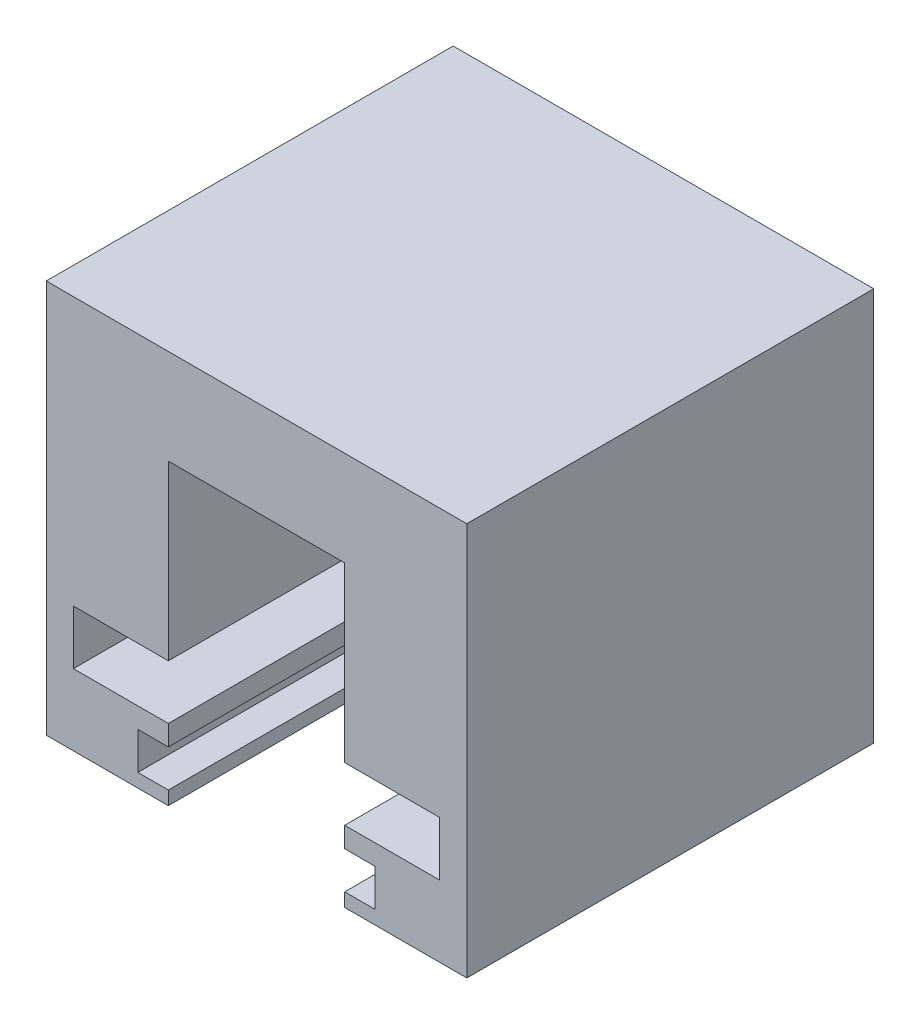
ISO-10303-21;
HEADER;
FILE_DESCRIPTION(('STEP AP214'),'2;1');
FILE_NAME('part.step','',(''),(''),'','','');
FILE_SCHEMA(('AUTOMOTIVE_DESIGN { 1 0 10303 214 1 1 1 1 }'));
ENDSEC;
DATA;
#1=APPLICATION_CONTEXT('core data for automotive mechanical design processes');
#2=APPLICATION_PROTOCOL_DEFINITION('international standard','automotive_design',2000,#1);
#3=PRODUCT_CONTEXT('',#1,'mechanical');
#4=PRODUCT('Part','Part','',(#3));
#5=PRODUCT_RELATED_PRODUCT_CATEGORY('part','',(#4));
#6=PRODUCT_DEFINITION_FORMATION('','',#4);
#7=PRODUCT_DEFINITION_CONTEXT('part definition',#1,'design');
#8=PRODUCT_DEFINITION('design','',#6,#7);
#9=PRODUCT_DEFINITION_SHAPE('','',#8);
#10=(LENGTH_UNIT() NAMED_UNIT(*) SI_UNIT(.MILLI.,.METRE.));
#11=(NAMED_UNIT(*) PLANE_ANGLE_UNIT() SI_UNIT($,.RADIAN.));
#12=(NAMED_UNIT(*) SI_UNIT($,.STERADIAN.) SOLID_ANGLE_UNIT());
#13=UNCERTAINTY_MEASURE_WITH_UNIT(LENGTH_MEASURE(1.E-05),#10,'distance_accuracy_value','');
#14=(GEOMETRIC_REPRESENTATION_CONTEXT(3) GLOBAL_UNCERTAINTY_ASSIGNED_CONTEXT((#13)) GLOBAL_UNIT_ASSIGNED_CONTEXT((#10,
#11,#12)) REPRESENTATION_CONTEXT('',''));
#15=CARTESIAN_POINT('',(0.,0.,0.));
#16=DIRECTION('',(0.,0.,1.));
#17=DIRECTION('',(1.,0.,0.));
#18=AXIS2_PLACEMENT_3D('',#15,#16,#17);
#19=CARTESIAN_POINT('',(0.,9.25,30.));
#20=DIRECTION('',(0.,-1.,0.));
#21=DIRECTION('',(0.,0.,-1.));
#22=AXIS2_PLACEMENT_3D('',#19,#20,#21);
#23=PLANE('',#22);
#24=DIRECTION('',(-1.,0.,0.));
#25=VECTOR('',#24,1.);
#26=CARTESIAN_POINT('',(0.,9.25,0.));
#27=LINE('',#26,#25);
#28=CARTESIAN_POINT('',(-2.,9.25,0.));
#29=VERTEX_POINT('',#28);
#30=CARTESIAN_POINT('',(-9.,9.25,0.));
#31=VERTEX_POINT('',#30);
#32=EDGE_CURVE('E228',#29,#31,#27,.T.);
#33=ORIENTED_EDGE('',*,*,#32,.F.);
#34=DIRECTION('',(0.,0.,-1.));
#35=VECTOR('',#34,1.);
#36=CARTESIAN_POINT('',(-2.,9.25,30.));
#37=LINE('',#36,#35);
#38=CARTESIAN_POINT('',(-2.,9.25,30.));
#39=VERTEX_POINT('',#38);
#40=EDGE_CURVE('E11',#39,#29,#37,.T.);
#41=ORIENTED_EDGE('',*,*,#40,.F.);
#42=DIRECTION('',(-1.,0.,0.));
#43=VECTOR('',#42,1.);
#44=CARTESIAN_POINT('',(0.,9.25,30.));
#45=LINE('',#44,#43);
#46=CARTESIAN_POINT('',(-9.,9.25,30.));
#47=VERTEX_POINT('',#46);
#48=EDGE_CURVE('E351',#39,#47,#45,.T.);
#49=ORIENTED_EDGE('',*,*,#48,.T.);
#50=DIRECTION('',(0.,0.,-1.));
#51=VECTOR('',#50,1.);
#52=CARTESIAN_POINT('',(-9.,9.25,30.));
#53=LINE('',#52,#51);
#54=EDGE_CURVE('E51',#47,#31,#53,.T.);
#55=ORIENTED_EDGE('',*,*,#54,.T.);
#56=EDGE_LOOP('',(#33,#41,#49,#55));
#57=FACE_BOUND('',#56,.T.);
#58=ADVANCED_FACE('F35',(#57),#23,.T.);
#59=CARTESIAN_POINT('',(-2.,0.,30.));
#60=DIRECTION('',(-1.,0.,0.));
#61=DIRECTION('',(0.,-1.,0.));
#62=AXIS2_PLACEMENT_3D('',#59,#60,#61);
#63=PLANE('',#62);
#64=DIRECTION('',(0.,1.,0.));
#65=VECTOR('',#64,1.);
#66=CARTESIAN_POINT('',(-2.,0.,0.));
#67=LINE('',#66,#65);
#68=CARTESIAN_POINT('',(-2.,5.25,0.));
#69=VERTEX_POINT('',#68);
#70=EDGE_CURVE('E230',#69,#29,#67,.T.);
#71=ORIENTED_EDGE('',*,*,#70,.F.);
#72=DIRECTION('',(0.,0.,-1.));
#73=VECTOR('',#72,1.);
#74=CARTESIAN_POINT('',(-2.,5.25,30.));
#75=LINE('',#74,#73);
#76=CARTESIAN_POINT('',(-2.,5.25,30.));
#77=VERTEX_POINT('',#76);
#78=EDGE_CURVE('E43',#77,#69,#75,.T.);
#79=ORIENTED_EDGE('',*,*,#78,.F.);
#80=DIRECTION('',(0.,1.,0.));
#81=VECTOR('',#80,1.);
#82=CARTESIAN_POINT('',(-2.,0.,30.));
#83=LINE('',#82,#81);
#84=EDGE_CURVE('E348',#77,#39,#83,.T.);
#85=ORIENTED_EDGE('',*,*,#84,.T.);
#86=ORIENTED_EDGE('',*,*,#40,.T.);
#87=EDGE_LOOP('',(#71,#79,#85,#86));
#88=FACE_BOUND('',#87,.T.);
#89=ADVANCED_FACE('F337',(#88),#63,.T.);
#90=CARTESIAN_POINT('',(0.,5.25,30.));
#91=DIRECTION('',(0.,1.,0.));
#92=DIRECTION('',(0.,0.,1.));
#93=AXIS2_PLACEMENT_3D('',#90,#91,#92);
#94=PLANE('',#93);
#95=DIRECTION('',(1.,0.,0.));
#96=VECTOR('',#95,1.);
#97=CARTESIAN_POINT('',(0.,5.25,0.));
#98=LINE('',#97,#96);
#99=CARTESIAN_POINT('',(-9.,5.25,0.));
#100=VERTEX_POINT('',#99);
#101=EDGE_CURVE('E233',#100,#69,#98,.T.);
#102=ORIENTED_EDGE('',*,*,#101,.F.);
#103=DIRECTION('',(0.,0.,-1.));
#104=VECTOR('',#103,1.);
#105=CARTESIAN_POINT('',(-9.,5.25,30.));
#106=LINE('',#105,#104);
#107=CARTESIAN_POINT('',(-9.,5.25,30.));
#108=VERTEX_POINT('',#107);
#109=EDGE_CURVE('E326',#108,#100,#106,.T.);
#110=ORIENTED_EDGE('',*,*,#109,.F.);
#111=DIRECTION('',(1.,0.,0.));
#112=VECTOR('',#111,1.);
#113=CARTESIAN_POINT('',(0.,5.25,30.));
#114=LINE('',#113,#112);
#115=EDGE_CURVE('E333',#108,#77,#114,.T.);
#116=ORIENTED_EDGE('',*,*,#115,.T.);
#117=ORIENTED_EDGE('',*,*,#78,.T.);
#118=EDGE_LOOP('',(#102,#110,#116,#117));
#119=FACE_BOUND('',#118,.T.);
#120=ADVANCED_FACE('F331',(#119),#94,.T.);
#121=CARTESIAN_POINT('',(-9.,0.,30.));
#122=DIRECTION('',(-1.,0.,0.));
#123=DIRECTION('',(0.,0.,1.));
#124=AXIS2_PLACEMENT_3D('',#121,#122,#123);
#125=PLANE('',#124);
#126=DIRECTION('',(0.,1.,0.));
#127=VECTOR('',#126,1.);
#128=CARTESIAN_POINT('',(-9.,0.,0.));
#129=LINE('',#128,#127);
#130=CARTESIAN_POINT('',(-9.,3.75,0.));
#131=VERTEX_POINT('',#130);
#132=EDGE_CURVE('E236',#131,#100,#129,.T.);
#133=ORIENTED_EDGE('',*,*,#132,.F.);
#134=DIRECTION('',(0.,0.,-1.));
#135=VECTOR('',#134,1.);
#136=CARTESIAN_POINT('',(-9.,3.75,30.));
#137=LINE('',#136,#135);
#138=CARTESIAN_POINT('',(-9.,3.75,30.));
#139=VERTEX_POINT('',#138);
#140=EDGE_CURVE('E324',#139,#131,#137,.T.);
#141=ORIENTED_EDGE('',*,*,#140,.F.);
#142=DIRECTION('',(0.,1.,0.));
#143=VECTOR('',#142,1.);
#144=CARTESIAN_POINT('',(-9.,0.,30.));
#145=LINE('',#144,#143);
#146=EDGE_CURVE('E224',#139,#108,#145,.T.);
#147=ORIENTED_EDGE('',*,*,#146,.T.);
#148=ORIENTED_EDGE('',*,*,#109,.T.);
#149=EDGE_LOOP('',(#133,#141,#147,#148));
#150=FACE_BOUND('',#149,.T.);
#151=ADVANCED_FACE('F343',(#150),#125,.T.);
#152=CARTESIAN_POINT('',(0.,3.75,30.));
#153=DIRECTION('',(0.,-1.,0.));
#154=DIRECTION('',(1.,0.,0.));
#155=AXIS2_PLACEMENT_3D('',#152,#153,#154);
#156=PLANE('',#155);
#157=DIRECTION('',(-1.,0.,0.));
#158=VECTOR('',#157,1.);
#159=CARTESIAN_POINT('',(0.,3.75,0.));
#160=LINE('',#159,#158);
#161=CARTESIAN_POINT('',(-6.75,3.75,0.));
#162=VERTEX_POINT('',#161);
#163=EDGE_CURVE('E239',#162,#131,#160,.T.);
#164=ORIENTED_EDGE('',*,*,#163,.F.);
#165=DIRECTION('',(0.,0.,-1.));
#166=VECTOR('',#165,1.);
#167=CARTESIAN_POINT('',(-6.75,3.75,30.));
#168=LINE('',#167,#166);
#169=CARTESIAN_POINT('',(-6.75,3.75,30.));
#170=VERTEX_POINT('',#169);
#171=EDGE_CURVE('E322',#170,#162,#168,.T.);
#172=ORIENTED_EDGE('',*,*,#171,.F.);
#173=DIRECTION('',(-1.,0.,0.));
#174=VECTOR('',#173,1.);
#175=CARTESIAN_POINT('',(0.,3.75,30.));
#176=LINE('',#175,#174);
#177=EDGE_CURVE('E350',#170,#139,#176,.T.);
#178=ORIENTED_EDGE('',*,*,#177,.T.);
#179=ORIENTED_EDGE('',*,*,#140,.T.);
#180=EDGE_LOOP('',(#164,#172,#178,#179));
#181=FACE_BOUND('',#180,.T.);
#182=ADVANCED_FACE('F460',(#181),#156,.T.);
#183=CARTESIAN_POINT('',(-6.75,0.,30.));
#184=DIRECTION('',(-1.,0.,0.));
#185=DIRECTION('',(0.,0.,1.));
#186=AXIS2_PLACEMENT_3D('',#183,#184,#185);
#187=PLANE('',#186);
#188=DIRECTION('',(0.,1.,0.));
#189=VECTOR('',#188,1.);
#190=CARTESIAN_POINT('',(-6.75,0.,0.));
#191=LINE('',#190,#189);
#192=CARTESIAN_POINT('',(-6.75,0.999999999999999,0.));
#193=VERTEX_POINT('',#192);
#194=EDGE_CURVE('E244',#193,#162,#191,.T.);
#195=ORIENTED_EDGE('',*,*,#194,.F.);
#196=DIRECTION('',(0.,0.,-1.));
#197=VECTOR('',#196,1.);
#198=CARTESIAN_POINT('',(-6.75,0.999999999999999,30.));
#199=LINE('',#198,#197);
#200=CARTESIAN_POINT('',(-6.75,0.999999999999999,30.));
#201=VERTEX_POINT('',#200);
#202=EDGE_CURVE('E320',#201,#193,#199,.T.);
#203=ORIENTED_EDGE('',*,*,#202,.F.);
#204=DIRECTION('',(0.,1.,0.));
#205=VECTOR('',#204,1.);
#206=CARTESIAN_POINT('',(-6.75,0.,30.));
#207=LINE('',#206,#205);
#208=EDGE_CURVE('E356',#201,#170,#207,.T.);
#209=ORIENTED_EDGE('',*,*,#208,.T.);
#210=ORIENTED_EDGE('',*,*,#171,.T.);
#211=EDGE_LOOP('',(#195,#203,#209,#210));
#212=FACE_BOUND('',#211,.T.);
#213=ADVANCED_FACE('F474',(#212),#187,.T.);
#214=CARTESIAN_POINT('',(0.,0.999999999999998,30.));
#215=DIRECTION('',(0.,1.,0.));
#216=DIRECTION('',(-1.,0.,0.));
#217=AXIS2_PLACEMENT_3D('',#214,#215,#216);
#218=PLANE('',#217);
#219=DIRECTION('',(1.,0.,0.));
#220=VECTOR('',#219,1.);
#221=CARTESIAN_POINT('',(0.,0.999999999999998,0.));
#222=LINE('',#221,#220);
#223=CARTESIAN_POINT('',(-9.,0.999999999999999,0.));
#224=VERTEX_POINT('',#223);
#225=EDGE_CURVE('E247',#224,#193,#222,.T.);
#226=ORIENTED_EDGE('',*,*,#225,.F.);
#227=DIRECTION('',(0.,0.,-1.));
#228=VECTOR('',#227,1.);
#229=CARTESIAN_POINT('',(-9.,0.999999999999999,30.));
#230=LINE('',#229,#228);
#231=CARTESIAN_POINT('',(-9.,0.999999999999999,30.));
#232=VERTEX_POINT('',#231);
#233=EDGE_CURVE('E318',#232,#224,#230,.T.);
#234=ORIENTED_EDGE('',*,*,#233,.F.);
#235=DIRECTION('',(1.,0.,0.));
#236=VECTOR('',#235,1.);
#237=CARTESIAN_POINT('',(0.,0.999999999999998,30.));
#238=LINE('',#237,#236);
#239=EDGE_CURVE('E359',#232,#201,#238,.T.);
#240=ORIENTED_EDGE('',*,*,#239,.T.);
#241=ORIENTED_EDGE('',*,*,#202,.T.);
#242=EDGE_LOOP('',(#226,#234,#240,#241));
#243=FACE_BOUND('',#242,.T.);
#244=ADVANCED_FACE('F462',(#243),#218,.T.);
#245=CARTESIAN_POINT('',(-9.,0.,0.));
#246=VERTEX_POINT('',#245);
#247=EDGE_CURVE('E241',#246,#224,#129,.T.);
#248=ORIENTED_EDGE('',*,*,#247,.F.);
#249=DIRECTION('',(0.,0.,-1.));
#250=VECTOR('',#249,1.);
#251=CARTESIAN_POINT('',(-9.,0.,30.));
#252=LINE('',#251,#250);
#253=CARTESIAN_POINT('',(-9.,0.,30.));
#254=VERTEX_POINT('',#253);
#255=EDGE_CURVE('E316',#254,#246,#252,.T.);
#256=ORIENTED_EDGE('',*,*,#255,.F.);
#257=EDGE_CURVE('E223',#254,#232,#145,.T.);
#258=ORIENTED_EDGE('',*,*,#257,.T.);
#259=ORIENTED_EDGE('',*,*,#233,.T.);
#260=EDGE_LOOP('',(#248,#256,#258,#259));
#261=FACE_BOUND('',#260,.T.);
#262=ADVANCED_FACE('F447',(#261),#125,.T.);
#263=CARTESIAN_POINT('',(0.,0.,30.));
#264=DIRECTION('',(0.,-1.,0.));
#265=DIRECTION('',(1.,0.,0.));
#266=AXIS2_PLACEMENT_3D('',#263,#264,#265);
#267=PLANE('',#266);
#268=DIRECTION('',(-1.,0.,0.));
#269=VECTOR('',#268,1.);
#270=CARTESIAN_POINT('',(0.,0.,0.));
#271=LINE('',#270,#269);
#272=CARTESIAN_POINT('',(0.,0.,0.));
#273=VERTEX_POINT('',#272);
#274=EDGE_CURVE('E250',#273,#246,#271,.T.);
#275=ORIENTED_EDGE('',*,*,#274,.F.);
#276=DIRECTION('',(0.,0.,-1.));
#277=VECTOR('',#276,1.);
#278=CARTESIAN_POINT('',(0.,0.,30.));
#279=LINE('',#278,#277);
#280=CARTESIAN_POINT('',(0.,0.,30.));
#281=VERTEX_POINT('',#280);
#282=EDGE_CURVE('E314',#281,#273,#279,.T.);
#283=ORIENTED_EDGE('',*,*,#282,.F.);
#284=DIRECTION('',(-1.,0.,0.));
#285=VECTOR('',#284,1.);
#286=CARTESIAN_POINT('',(0.,0.,30.));
#287=LINE('',#286,#285);
#288=EDGE_CURVE('E362',#281,#254,#287,.T.);
#289=ORIENTED_EDGE('',*,*,#288,.T.);
#290=ORIENTED_EDGE('',*,*,#255,.T.);
#291=EDGE_LOOP('',(#275,#283,#289,#290));
#292=FACE_BOUND('',#291,.T.);
#293=ADVANCED_FACE('F442',(#292),#267,.T.);
#294=CARTESIAN_POINT('',(0.,0.,30.));
#295=DIRECTION('',(1.,0.,0.));
#296=DIRECTION('',(0.,0.,-1.));
#297=AXIS2_PLACEMENT_3D('',#294,#295,#296);
#298=PLANE('',#297);
#299=DIRECTION('',(0.,-1.,0.));
#300=VECTOR('',#299,1.);
#301=CARTESIAN_POINT('',(0.,0.,0.));
#302=LINE('',#301,#300);
#303=CARTESIAN_POINT('',(0.,29.,0.));
#304=VERTEX_POINT('',#303);
#305=EDGE_CURVE('E253',#304,#273,#302,.T.);
#306=ORIENTED_EDGE('',*,*,#305,.F.);
#307=DIRECTION('',(0.,0.,-1.));
#308=VECTOR('',#307,1.);
#309=CARTESIAN_POINT('',(0.,29.,30.));
#310=LINE('',#309,#308);
#311=CARTESIAN_POINT('',(0.,29.,30.));
#312=VERTEX_POINT('',#311);
#313=EDGE_CURVE('E312',#312,#304,#310,.T.);
#314=ORIENTED_EDGE('',*,*,#313,.F.);
#315=DIRECTION('',(0.,-1.,0.));
#316=VECTOR('',#315,1.);
#317=CARTESIAN_POINT('',(0.,0.,30.));
#318=LINE('',#317,#316);
#319=EDGE_CURVE('E365',#312,#281,#318,.T.);
#320=ORIENTED_EDGE('',*,*,#319,.T.);
#321=ORIENTED_EDGE('',*,*,#282,.T.);
#322=EDGE_LOOP('',(#306,#314,#320,#321));
#323=FACE_BOUND('',#322,.T.);
#324=ADVANCED_FACE('F437',(#323),#298,.T.);
#325=CARTESIAN_POINT('',(0.,29.,30.));
#326=DIRECTION('',(0.,1.,0.));
#327=DIRECTION('',(-1.,0.,0.));
#328=AXIS2_PLACEMENT_3D('',#325,#326,#327);
#329=PLANE('',#328);
#330=DIRECTION('',(1.,0.,0.));
#331=VECTOR('',#330,1.);
#332=CARTESIAN_POINT('',(0.,29.,0.));
#333=LINE('',#332,#331);
#334=CARTESIAN_POINT('',(-31.,29.,0.));
#335=VERTEX_POINT('',#334);
#336=EDGE_CURVE('E256',#335,#304,#333,.T.);
#337=ORIENTED_EDGE('',*,*,#336,.F.);
#338=DIRECTION('',(0.,0.,-1.));
#339=VECTOR('',#338,1.);
#340=CARTESIAN_POINT('',(-31.,29.,30.));
#341=LINE('',#340,#339);
#342=CARTESIAN_POINT('',(-31.,29.,30.));
#343=VERTEX_POINT('',#342);
#344=EDGE_CURVE('E310',#343,#335,#341,.T.);
#345=ORIENTED_EDGE('',*,*,#344,.F.);
#346=DIRECTION('',(1.,0.,0.));
#347=VECTOR('',#346,1.);
#348=CARTESIAN_POINT('',(0.,29.,30.));
#349=LINE('',#348,#347);
#350=EDGE_CURVE('E368',#343,#312,#349,.T.);
#351=ORIENTED_EDGE('',*,*,#350,.T.);
#352=ORIENTED_EDGE('',*,*,#313,.T.);
#353=EDGE_LOOP('',(#337,#345,#351,#352));
#354=FACE_BOUND('',#353,.T.);
#355=ADVANCED_FACE('F433',(#354),#329,.T.);
#356=CARTESIAN_POINT('',(-31.,0.,30.));
#357=DIRECTION('',(-1.,0.,0.));
#358=DIRECTION('',(0.,0.,1.));
#359=AXIS2_PLACEMENT_3D('',#356,#357,#358);
#360=PLANE('',#359);
#361=DIRECTION('',(0.,1.,0.));
#362=VECTOR('',#361,1.);
#363=CARTESIAN_POINT('',(-31.,0.,0.));
#364=LINE('',#363,#362);
#365=CARTESIAN_POINT('',(-31.,0.,0.));
#366=VERTEX_POINT('',#365);
#367=EDGE_CURVE('E259',#366,#335,#364,.T.);
#368=ORIENTED_EDGE('',*,*,#367,.F.);
#369=DIRECTION('',(0.,0.,-1.));
#370=VECTOR('',#369,1.);
#371=CARTESIAN_POINT('',(-31.,0.,30.));
#372=LINE('',#371,#370);
#373=CARTESIAN_POINT('',(-31.,0.,30.));
#374=VERTEX_POINT('',#373);
#375=EDGE_CURVE('E308',#374,#366,#372,.T.);
#376=ORIENTED_EDGE('',*,*,#375,.F.);
#377=DIRECTION('',(0.,1.,0.));
#378=VECTOR('',#377,1.);
#379=CARTESIAN_POINT('',(-31.,0.,30.));
#380=LINE('',#379,#378);
#381=EDGE_CURVE('E371',#374,#343,#380,.T.);
#382=ORIENTED_EDGE('',*,*,#381,.T.);
#383=ORIENTED_EDGE('',*,*,#344,.T.);
#384=EDGE_LOOP('',(#368,#376,#382,#383));
#385=FACE_BOUND('',#384,.T.);
#386=ADVANCED_FACE('F429',(#385),#360,.T.);
#387=CARTESIAN_POINT('',(0.,0.,30.));
#388=DIRECTION('',(0.,-1.,0.));
#389=DIRECTION('',(1.,0.,0.));
#390=AXIS2_PLACEMENT_3D('',#387,#388,#389);
#391=PLANE('',#390);
#392=DIRECTION('',(-1.,0.,0.));
#393=VECTOR('',#392,1.);
#394=CARTESIAN_POINT('',(0.,0.,0.));
#395=LINE('',#394,#393);
#396=CARTESIAN_POINT('',(-22.,0.,0.));
#397=VERTEX_POINT('',#396);
#398=EDGE_CURVE('E262',#397,#366,#395,.T.);
#399=ORIENTED_EDGE('',*,*,#398,.F.);
#400=DIRECTION('',(0.,0.,-1.));
#401=VECTOR('',#400,1.);
#402=CARTESIAN_POINT('',(-22.,0.,30.));
#403=LINE('',#402,#401);
#404=CARTESIAN_POINT('',(-22.,0.,30.));
#405=VERTEX_POINT('',#404);
#406=EDGE_CURVE('E306',#405,#397,#403,.T.);
#407=ORIENTED_EDGE('',*,*,#406,.F.);
#408=DIRECTION('',(-1.,0.,0.));
#409=VECTOR('',#408,1.);
#410=CARTESIAN_POINT('',(0.,0.,30.));
#411=LINE('',#410,#409);
#412=EDGE_CURVE('E374',#405,#374,#411,.T.);
#413=ORIENTED_EDGE('',*,*,#412,.T.);
#414=ORIENTED_EDGE('',*,*,#375,.T.);
#415=EDGE_LOOP('',(#399,#407,#413,#414));
#416=FACE_BOUND('',#415,.T.);
#417=ADVANCED_FACE('F425',(#416),#391,.T.);
#418=CARTESIAN_POINT('',(-22.,0.,30.));
#419=DIRECTION('',(1.,0.,0.));
#420=DIRECTION('',(0.,1.,0.));
#421=AXIS2_PLACEMENT_3D('',#418,#419,#420);
#422=PLANE('',#421);
#423=DIRECTION('',(0.,-1.,0.));
#424=VECTOR('',#423,1.);
#425=CARTESIAN_POINT('',(-22.,0.,0.));
#426=LINE('',#425,#424);
#427=CARTESIAN_POINT('',(-22.,0.999999999999997,0.));
#428=VERTEX_POINT('',#427);
#429=EDGE_CURVE('E265',#428,#397,#426,.T.);
#430=ORIENTED_EDGE('',*,*,#429,.F.);
#431=DIRECTION('',(0.,0.,-1.));
#432=VECTOR('',#431,1.);
#433=CARTESIAN_POINT('',(-22.,0.999999999999997,30.));
#434=LINE('',#433,#432);
#435=CARTESIAN_POINT('',(-22.,0.999999999999997,30.));
#436=VERTEX_POINT('',#435);
#437=EDGE_CURVE('E304',#436,#428,#434,.T.);
#438=ORIENTED_EDGE('',*,*,#437,.F.);
#439=DIRECTION('',(0.,-1.,0.));
#440=VECTOR('',#439,1.);
#441=CARTESIAN_POINT('',(-22.,0.,30.));
#442=LINE('',#441,#440);
#443=EDGE_CURVE('E218',#436,#405,#442,.T.);
#444=ORIENTED_EDGE('',*,*,#443,.T.);
#445=ORIENTED_EDGE('',*,*,#406,.T.);
#446=EDGE_LOOP('',(#430,#438,#444,#445));
#447=FACE_BOUND('',#446,.T.);
#448=ADVANCED_FACE('F419',(#447),#422,.T.);
#449=CARTESIAN_POINT('',(0.,0.999999999999997,30.));
#450=DIRECTION('',(0.,-1.,0.));
#451=DIRECTION('',(0.,0.,-1.));
#452=AXIS2_PLACEMENT_3D('',#449,#450,#451);
#453=PLANE('',#452);
#454=DIRECTION('',(-1.,0.,0.));
#455=VECTOR('',#454,1.);
#456=CARTESIAN_POINT('',(0.,0.999999999999997,0.));
#457=LINE('',#456,#455);
#458=CARTESIAN_POINT('',(-24.25,0.999999999999997,0.));
#459=VERTEX_POINT('',#458);
#460=EDGE_CURVE('E268',#428,#459,#457,.T.);
#461=ORIENTED_EDGE('',*,*,#460,.T.);
#462=DIRECTION('',(0.,0.,-1.));
#463=VECTOR('',#462,1.);
#464=CARTESIAN_POINT('',(-24.25,0.999999999999997,30.));
#465=LINE('',#464,#463);
#466=CARTESIAN_POINT('',(-24.25,0.999999999999997,30.));
#467=VERTEX_POINT('',#466);
#468=EDGE_CURVE('E301',#467,#459,#465,.T.);
#469=ORIENTED_EDGE('',*,*,#468,.F.);
#470=DIRECTION('',(-1.,0.,0.));
#471=VECTOR('',#470,1.);
#472=CARTESIAN_POINT('',(0.,0.999999999999997,30.));
#473=LINE('',#472,#471);
#474=EDGE_CURVE('E378',#436,#467,#473,.T.);
#475=ORIENTED_EDGE('',*,*,#474,.F.);
#476=ORIENTED_EDGE('',*,*,#437,.T.);
#477=EDGE_LOOP('',(#461,#469,#475,#476));
#478=FACE_BOUND('',#477,.T.);
#479=ADVANCED_FACE('F492',(#478),#453,.F.);
#480=CARTESIAN_POINT('',(-24.25,0.,30.));
#481=DIRECTION('',(-1.,0.,0.));
#482=DIRECTION('',(0.,0.,1.));
#483=AXIS2_PLACEMENT_3D('',#480,#481,#482);
#484=PLANE('',#483);
#485=DIRECTION('',(0.,1.,0.));
#486=VECTOR('',#485,1.);
#487=CARTESIAN_POINT('',(-24.25,0.,0.));
#488=LINE('',#487,#486);
#489=CARTESIAN_POINT('',(-24.25,3.75,0.));
#490=VERTEX_POINT('',#489);
#491=EDGE_CURVE('E271',#459,#490,#488,.T.);
#492=ORIENTED_EDGE('',*,*,#491,.T.);
#493=DIRECTION('',(0.,0.,-1.));
#494=VECTOR('',#493,1.);
#495=CARTESIAN_POINT('',(-24.25,3.75,30.));
#496=LINE('',#495,#494);
#497=CARTESIAN_POINT('',(-24.25,3.75,30.));
#498=VERTEX_POINT('',#497);
#499=EDGE_CURVE('E298',#498,#490,#496,.T.);
#500=ORIENTED_EDGE('',*,*,#499,.F.);
#501=DIRECTION('',(0.,1.,0.));
#502=VECTOR('',#501,1.);
#503=CARTESIAN_POINT('',(-24.25,0.,30.));
#504=LINE('',#503,#502);
#505=EDGE_CURVE('E380',#467,#498,#504,.T.);
#506=ORIENTED_EDGE('',*,*,#505,.F.);
#507=ORIENTED_EDGE('',*,*,#468,.T.);
#508=EDGE_LOOP('',(#492,#500,#506,#507));
#509=FACE_BOUND('',#508,.T.);
#510=ADVANCED_FACE('F413',(#509),#484,.F.);
#511=CARTESIAN_POINT('',(0.,3.74999999999999,30.));
#512=DIRECTION('',(0.,1.,0.));
#513=DIRECTION('',(-1.,0.,0.));
#514=AXIS2_PLACEMENT_3D('',#511,#512,#513);
#515=PLANE('',#514);
#516=DIRECTION('',(1.,0.,0.));
#517=VECTOR('',#516,1.);
#518=CARTESIAN_POINT('',(0.,3.74999999999999,0.));
#519=LINE('',#518,#517);
#520=CARTESIAN_POINT('',(-22.,3.75,0.));
#521=VERTEX_POINT('',#520);
#522=EDGE_CURVE('E273',#490,#521,#519,.T.);
#523=ORIENTED_EDGE('',*,*,#522,.T.);
#524=DIRECTION('',(0.,0.,-1.));
#525=VECTOR('',#524,1.);
#526=CARTESIAN_POINT('',(-22.,3.75,30.));
#527=LINE('',#526,#525);
#528=CARTESIAN_POINT('',(-22.,3.75,30.));
#529=VERTEX_POINT('',#528);
#530=EDGE_CURVE('E296',#529,#521,#527,.T.);
#531=ORIENTED_EDGE('',*,*,#530,.F.);
#532=DIRECTION('',(1.,0.,0.));
#533=VECTOR('',#532,1.);
#534=CARTESIAN_POINT('',(0.,3.74999999999999,30.));
#535=LINE('',#534,#533);
#536=EDGE_CURVE('E382',#498,#529,#535,.T.);
#537=ORIENTED_EDGE('',*,*,#536,.F.);
#538=ORIENTED_EDGE('',*,*,#499,.T.);
#539=EDGE_LOOP('',(#523,#531,#537,#538));
#540=FACE_BOUND('',#539,.T.);
#541=ADVANCED_FACE('F409',(#540),#515,.F.);
#542=CARTESIAN_POINT('',(-22.,5.25,0.));
#543=VERTEX_POINT('',#542);
#544=EDGE_CURVE('E269',#543,#521,#426,.T.);
#545=ORIENTED_EDGE('',*,*,#544,.F.);
#546=DIRECTION('',(0.,0.,-1.));
#547=VECTOR('',#546,1.);
#548=CARTESIAN_POINT('',(-22.,5.25,30.));
#549=LINE('',#548,#547);
#550=CARTESIAN_POINT('',(-22.,5.25,30.));
#551=VERTEX_POINT('',#550);
#552=EDGE_CURVE('E294',#551,#543,#549,.T.);
#553=ORIENTED_EDGE('',*,*,#552,.F.);
#554=EDGE_CURVE('E217',#551,#529,#442,.T.);
#555=ORIENTED_EDGE('',*,*,#554,.T.);
#556=ORIENTED_EDGE('',*,*,#530,.T.);
#557=EDGE_LOOP('',(#545,#553,#555,#556));
#558=FACE_BOUND('',#557,.T.);
#559=ADVANCED_FACE('F404',(#558),#422,.T.);
#560=CARTESIAN_POINT('',(0.,5.25,30.));
#561=DIRECTION('',(0.,-1.,0.));
#562=DIRECTION('',(1.,0.,0.));
#563=AXIS2_PLACEMENT_3D('',#560,#561,#562);
#564=PLANE('',#563);
#565=DIRECTION('',(-1.,0.,0.));
#566=VECTOR('',#565,1.);
#567=CARTESIAN_POINT('',(0.,5.25,0.));
#568=LINE('',#567,#566);
#569=CARTESIAN_POINT('',(-29.,5.25,0.));
#570=VERTEX_POINT('',#569);
#571=EDGE_CURVE('E276',#543,#570,#568,.T.);
#572=ORIENTED_EDGE('',*,*,#571,.T.);
#573=DIRECTION('',(0.,0.,-1.));
#574=VECTOR('',#573,1.);
#575=CARTESIAN_POINT('',(-29.,5.25,30.));
#576=LINE('',#575,#574);
#577=CARTESIAN_POINT('',(-29.,5.25,30.));
#578=VERTEX_POINT('',#577);
#579=EDGE_CURVE('E291',#578,#570,#576,.T.);
#580=ORIENTED_EDGE('',*,*,#579,.F.);
#581=DIRECTION('',(-1.,0.,0.));
#582=VECTOR('',#581,1.);
#583=CARTESIAN_POINT('',(0.,5.25,30.));
#584=LINE('',#583,#582);
#585=EDGE_CURVE('E384',#551,#578,#584,.T.);
#586=ORIENTED_EDGE('',*,*,#585,.F.);
#587=ORIENTED_EDGE('',*,*,#552,.T.);
#588=EDGE_LOOP('',(#572,#580,#586,#587));
#589=FACE_BOUND('',#588,.T.);
#590=ADVANCED_FACE('F499',(#589),#564,.F.);
#591=CARTESIAN_POINT('',(-29.,0.,30.));
#592=DIRECTION('',(-1.,0.,0.));
#593=DIRECTION('',(0.,0.,1.));
#594=AXIS2_PLACEMENT_3D('',#591,#592,#593);
#595=PLANE('',#594);
#596=DIRECTION('',(0.,1.,0.));
#597=VECTOR('',#596,1.);
#598=CARTESIAN_POINT('',(-29.,0.,0.));
#599=LINE('',#598,#597);
#600=CARTESIAN_POINT('',(-29.,9.25,0.));
#601=VERTEX_POINT('',#600);
#602=EDGE_CURVE('E278',#570,#601,#599,.T.);
#603=ORIENTED_EDGE('',*,*,#602,.T.);
#604=DIRECTION('',(0.,0.,-1.));
#605=VECTOR('',#604,1.);
#606=CARTESIAN_POINT('',(-29.,9.25,30.));
#607=LINE('',#606,#605);
#608=CARTESIAN_POINT('',(-29.,9.25,30.));
#609=VERTEX_POINT('',#608);
#610=EDGE_CURVE('E288',#609,#601,#607,.T.);
#611=ORIENTED_EDGE('',*,*,#610,.F.);
#612=DIRECTION('',(0.,1.,0.));
#613=VECTOR('',#612,1.);
#614=CARTESIAN_POINT('',(-29.,0.,30.));
#615=LINE('',#614,#613);
#616=EDGE_CURVE('E385',#578,#609,#615,.T.);
#617=ORIENTED_EDGE('',*,*,#616,.F.);
#618=ORIENTED_EDGE('',*,*,#579,.T.);
#619=EDGE_LOOP('',(#603,#611,#617,#618));
#620=FACE_BOUND('',#619,.T.);
#621=ADVANCED_FACE('F392',(#620),#595,.F.);
#622=CARTESIAN_POINT('',(0.,9.25,30.));
#623=DIRECTION('',(0.,1.,0.));
#624=DIRECTION('',(0.,0.,1.));
#625=AXIS2_PLACEMENT_3D('',#622,#623,#624);
#626=PLANE('',#625);
#627=DIRECTION('',(1.,0.,0.));
#628=VECTOR('',#627,1.);
#629=CARTESIAN_POINT('',(0.,9.25,0.));
#630=LINE('',#629,#628);
#631=CARTESIAN_POINT('',(-22.,9.25,0.));
#632=VERTEX_POINT('',#631);
#633=EDGE_CURVE('E280',#601,#632,#630,.T.);
#634=ORIENTED_EDGE('',*,*,#633,.T.);
#635=DIRECTION('',(0.,0.,-1.));
#636=VECTOR('',#635,1.);
#637=CARTESIAN_POINT('',(-22.,9.25,30.));
#638=LINE('',#637,#636);
#639=CARTESIAN_POINT('',(-22.,9.25,30.));
#640=VERTEX_POINT('',#639);
#641=EDGE_CURVE('E206',#640,#632,#638,.T.);
#642=ORIENTED_EDGE('',*,*,#641,.F.);
#643=DIRECTION('',(1.,0.,0.));
#644=VECTOR('',#643,1.);
#645=CARTESIAN_POINT('',(0.,9.25,30.));
#646=LINE('',#645,#644);
#647=EDGE_CURVE('E214',#609,#640,#646,.T.);
#648=ORIENTED_EDGE('',*,*,#647,.F.);
#649=ORIENTED_EDGE('',*,*,#610,.T.);
#650=EDGE_LOOP('',(#634,#642,#648,#649));
#651=FACE_BOUND('',#650,.T.);
#652=ADVANCED_FACE('F396',(#651),#626,.F.);
#653=CARTESIAN_POINT('',(-22.,22.,0.));
#654=VERTEX_POINT('',#653);
#655=EDGE_CURVE('E202',#654,#632,#426,.T.);
#656=ORIENTED_EDGE('',*,*,#655,.F.);
#657=DIRECTION('',(0.,0.,-1.));
#658=VECTOR('',#657,1.);
#659=CARTESIAN_POINT('',(-22.,22.,30.));
#660=LINE('',#659,#658);
#661=CARTESIAN_POINT('',(-22.,22.,30.));
#662=VERTEX_POINT('',#661);
#663=EDGE_CURVE('E197',#662,#654,#660,.T.);
#664=ORIENTED_EDGE('',*,*,#663,.F.);
#665=EDGE_CURVE('E200',#662,#640,#442,.T.);
#666=ORIENTED_EDGE('',*,*,#665,.T.);
#667=ORIENTED_EDGE('',*,*,#641,.T.);
#668=EDGE_LOOP('',(#656,#664,#666,#667));
#669=FACE_BOUND('',#668,.T.);
#670=ADVANCED_FACE('F199',(#669),#422,.T.);
#671=CARTESIAN_POINT('',(0.,22.,30.));
#672=DIRECTION('',(0.,-1.,0.));
#673=DIRECTION('',(0.,0.,-1.));
#674=AXIS2_PLACEMENT_3D('',#671,#672,#673);
#675=PLANE('',#674);
#676=DIRECTION('',(-1.,0.,0.));
#677=VECTOR('',#676,1.);
#678=CARTESIAN_POINT('',(0.,22.,0.));
#679=LINE('',#678,#677);
#680=CARTESIAN_POINT('',(-9.,22.,0.));
#681=VERTEX_POINT('',#680);
#682=EDGE_CURVE('E283',#681,#654,#679,.T.);
#683=ORIENTED_EDGE('',*,*,#682,.F.);
#684=DIRECTION('',(0.,0.,-1.));
#685=VECTOR('',#684,1.);
#686=CARTESIAN_POINT('',(-9.,22.,30.));
#687=LINE('',#686,#685);
#688=CARTESIAN_POINT('',(-9.,22.,30.));
#689=VERTEX_POINT('',#688);
#690=EDGE_CURVE('E124',#689,#681,#687,.T.);
#691=ORIENTED_EDGE('',*,*,#690,.F.);
#692=DIRECTION('',(-1.,0.,0.));
#693=VECTOR('',#692,1.);
#694=CARTESIAN_POINT('',(0.,22.,30.));
#695=LINE('',#694,#693);
#696=EDGE_CURVE('E212',#689,#662,#695,.T.);
#697=ORIENTED_EDGE('',*,*,#696,.T.);
#698=ORIENTED_EDGE('',*,*,#663,.T.);
#699=EDGE_LOOP('',(#683,#691,#697,#698));
#700=FACE_BOUND('',#699,.T.);
#701=ADVANCED_FACE('F219',(#700),#675,.T.);
#702=EDGE_CURVE('E240',#31,#681,#129,.T.);
#703=ORIENTED_EDGE('',*,*,#702,.F.);
#704=ORIENTED_EDGE('',*,*,#54,.F.);
#705=EDGE_CURVE('E220',#47,#689,#145,.T.);
#706=ORIENTED_EDGE('',*,*,#705,.T.);
#707=ORIENTED_EDGE('',*,*,#690,.T.);
#708=EDGE_LOOP('',(#703,#704,#706,#707));
#709=FACE_BOUND('',#708,.T.);
#710=ADVANCED_FACE('F449',(#709),#125,.T.);
#711=CARTESIAN_POINT('',(0.,0.,30.));
#712=DIRECTION('',(0.,0.,1.));
#713=DIRECTION('',(1.,0.,0.));
#714=AXIS2_PLACEMENT_3D('',#711,#712,#713);
#715=PLANE('',#714);
#716=ORIENTED_EDGE('',*,*,#48,.F.);
#717=ORIENTED_EDGE('',*,*,#84,.F.);
#718=ORIENTED_EDGE('',*,*,#115,.F.);
#719=ORIENTED_EDGE('',*,*,#146,.F.);
#720=ORIENTED_EDGE('',*,*,#177,.F.);
#721=ORIENTED_EDGE('',*,*,#208,.F.);
#722=ORIENTED_EDGE('',*,*,#239,.F.);
#723=ORIENTED_EDGE('',*,*,#257,.F.);
#724=ORIENTED_EDGE('',*,*,#288,.F.);
#725=ORIENTED_EDGE('',*,*,#319,.F.);
#726=ORIENTED_EDGE('',*,*,#350,.F.);
#727=ORIENTED_EDGE('',*,*,#381,.F.);
#728=ORIENTED_EDGE('',*,*,#412,.F.);
#729=ORIENTED_EDGE('',*,*,#443,.F.);
#730=ORIENTED_EDGE('',*,*,#474,.T.);
#731=ORIENTED_EDGE('',*,*,#505,.T.);
#732=ORIENTED_EDGE('',*,*,#536,.T.);
#733=ORIENTED_EDGE('',*,*,#554,.F.);
#734=ORIENTED_EDGE('',*,*,#585,.T.);
#735=ORIENTED_EDGE('',*,*,#616,.T.);
#736=ORIENTED_EDGE('',*,*,#647,.T.);
#737=ORIENTED_EDGE('',*,*,#665,.F.);
#738=ORIENTED_EDGE('',*,*,#696,.F.);
#739=ORIENTED_EDGE('',*,*,#705,.F.);
#740=EDGE_LOOP('',(#716,#717,#718,#719,#720,#721,#722,#723,#724,#725,#726,#727,#728,#729,#730,
#731,#732,#733,#734,#735,#736,#737,#738,#739));
#741=FACE_BOUND('',#740,.T.);
#742=ADVANCED_FACE('F210',(#741),#715,.T.);
#743=CARTESIAN_POINT('',(0.,0.,0.));
#744=DIRECTION('',(0.,0.,1.));
#745=DIRECTION('',(1.,0.,0.));
#746=AXIS2_PLACEMENT_3D('',#743,#744,#745);
#747=PLANE('',#746);
#748=ORIENTED_EDGE('',*,*,#32,.T.);
#749=ORIENTED_EDGE('',*,*,#702,.T.);
#750=ORIENTED_EDGE('',*,*,#682,.T.);
#751=ORIENTED_EDGE('',*,*,#655,.T.);
#752=ORIENTED_EDGE('',*,*,#633,.F.);
#753=ORIENTED_EDGE('',*,*,#602,.F.);
#754=ORIENTED_EDGE('',*,*,#571,.F.);
#755=ORIENTED_EDGE('',*,*,#544,.T.);
#756=ORIENTED_EDGE('',*,*,#522,.F.);
#757=ORIENTED_EDGE('',*,*,#491,.F.);
#758=ORIENTED_EDGE('',*,*,#460,.F.);
#759=ORIENTED_EDGE('',*,*,#429,.T.);
#760=ORIENTED_EDGE('',*,*,#398,.T.);
#761=ORIENTED_EDGE('',*,*,#367,.T.);
#762=ORIENTED_EDGE('',*,*,#336,.T.);
#763=ORIENTED_EDGE('',*,*,#305,.T.);
#764=ORIENTED_EDGE('',*,*,#274,.T.);
#765=ORIENTED_EDGE('',*,*,#247,.T.);
#766=ORIENTED_EDGE('',*,*,#225,.T.);
#767=ORIENTED_EDGE('',*,*,#194,.T.);
#768=ORIENTED_EDGE('',*,*,#163,.T.);
#769=ORIENTED_EDGE('',*,*,#132,.T.);
#770=ORIENTED_EDGE('',*,*,#101,.T.);
#771=ORIENTED_EDGE('',*,*,#70,.T.);
#772=EDGE_LOOP('',(#748,#749,#750,#751,#752,#753,#754,#755,#756,#757,#758,#759,#760,#761,#762,
#763,#764,#765,#766,#767,#768,#769,#770,#771));
#773=FACE_BOUND('',#772,.T.);
#774=ADVANCED_FACE('F339',(#773),#747,.F.);
#775=CLOSED_SHELL('',(#58,#89,#120,#151,#182,#213,#244,#262,#293,#324,#355,#386,#417,#448,#479,
#510,#541,#559,#590,#621,#652,#670,#701,#710,#742,#774));
#776=MANIFOLD_SOLID_BREP('B2',#775);
#777=ADVANCED_BREP_SHAPE_REPRESENTATION('',(#18,#776),#14);
#778=SHAPE_DEFINITION_REPRESENTATION(#9,#777);
ENDSEC;
END-ISO-10303-21;
